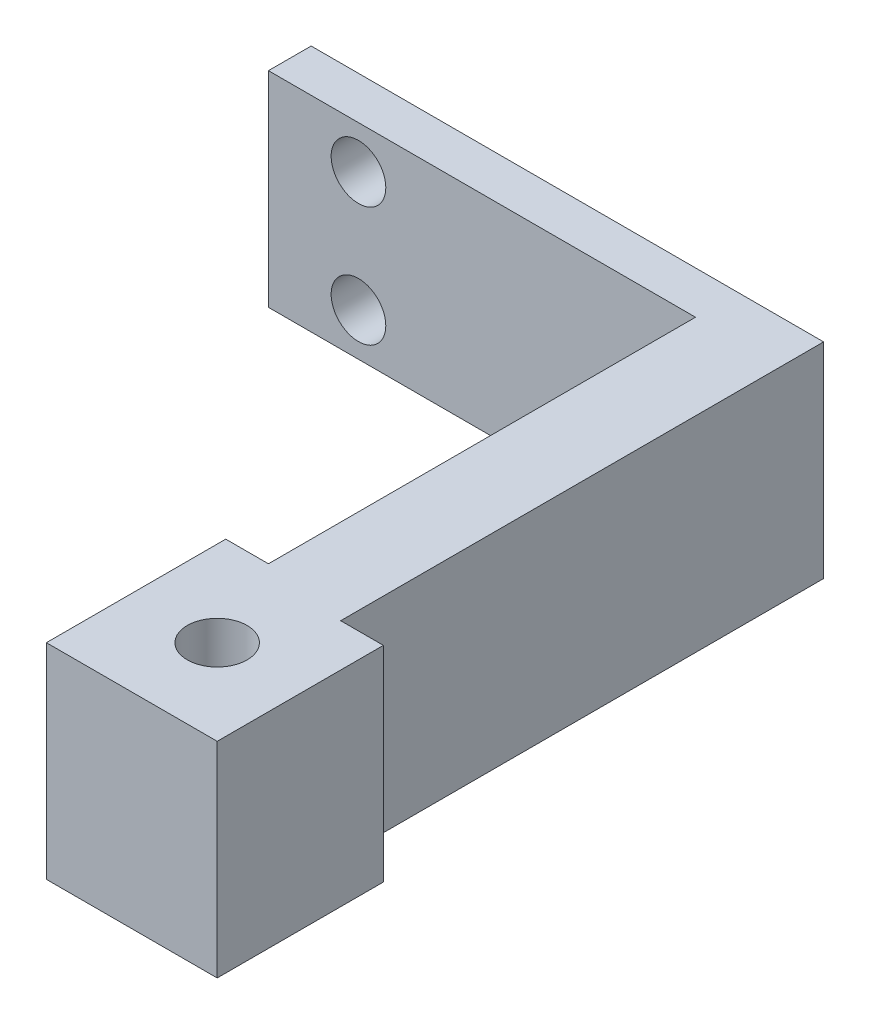
ISO-10303-21;
HEADER;
FILE_DESCRIPTION(('STEP AP214'),'2;1');
FILE_NAME('part.step','',(''),(''),'','','');
FILE_SCHEMA(('AUTOMOTIVE_DESIGN { 1 0 10303 214 1 1 1 1 }'));
ENDSEC;
DATA;
#1=APPLICATION_CONTEXT('core data for automotive mechanical design processes');
#2=APPLICATION_PROTOCOL_DEFINITION('international standard','automotive_design',2000,#1);
#3=PRODUCT_CONTEXT('',#1,'mechanical');
#4=PRODUCT('Part','Part','',(#3));
#5=PRODUCT_RELATED_PRODUCT_CATEGORY('part','',(#4));
#6=PRODUCT_DEFINITION_FORMATION('','',#4);
#7=PRODUCT_DEFINITION_CONTEXT('part definition',#1,'design');
#8=PRODUCT_DEFINITION('design','',#6,#7);
#9=PRODUCT_DEFINITION_SHAPE('','',#8);
#10=(LENGTH_UNIT() NAMED_UNIT(*) SI_UNIT(.MILLI.,.METRE.));
#11=(NAMED_UNIT(*) PLANE_ANGLE_UNIT() SI_UNIT($,.RADIAN.));
#12=(NAMED_UNIT(*) SI_UNIT($,.STERADIAN.) SOLID_ANGLE_UNIT());
#13=UNCERTAINTY_MEASURE_WITH_UNIT(LENGTH_MEASURE(1.E-05),#10,'distance_accuracy_value','');
#14=(GEOMETRIC_REPRESENTATION_CONTEXT(3) GLOBAL_UNCERTAINTY_ASSIGNED_CONTEXT((#13)) GLOBAL_UNIT_ASSIGNED_CONTEXT((#10,
#11,#12)) REPRESENTATION_CONTEXT('',''));
#15=CARTESIAN_POINT('',(0.,0.,0.));
#16=DIRECTION('',(0.,0.,1.));
#17=DIRECTION('',(1.,0.,0.));
#18=AXIS2_PLACEMENT_3D('',#15,#16,#17);
#19=CARTESIAN_POINT('',(-1.649648438219,12.,-29.2913223140496));
#20=DIRECTION('',(1.,0.,0.));
#21=DIRECTION('',(0.,0.,-1.));
#22=AXIS2_PLACEMENT_3D('',#19,#20,#21);
#23=PLANE('',#22);
#24=DIRECTION('',(0.,-1.,0.));
#25=VECTOR('',#24,1.);
#26=CARTESIAN_POINT('',(-1.649648438219,12.,-4.29132231404959));
#27=LINE('',#26,#25);
#28=CARTESIAN_POINT('',(-1.649648438219,12.,-4.29132231404959));
#29=VERTEX_POINT('',#28);
#30=CARTESIAN_POINT('',(-1.649648438219,0.,-4.29132231404959));
#31=VERTEX_POINT('',#30);
#32=EDGE_CURVE('E48',#29,#31,#27,.T.);
#33=ORIENTED_EDGE('',*,*,#32,.F.);
#34=DIRECTION('',(0.,0.,1.));
#35=VECTOR('',#34,1.);
#36=CARTESIAN_POINT('',(-1.649648438219,12.,-29.2913223140496));
#37=LINE('',#36,#35);
#38=CARTESIAN_POINT('',(-1.649648438219,12.,-29.2913223140496));
#39=VERTEX_POINT('',#38);
#40=EDGE_CURVE('E115',#39,#29,#37,.T.);
#41=ORIENTED_EDGE('',*,*,#40,.F.);
#42=DIRECTION('',(0.,-1.,0.));
#43=VECTOR('',#42,1.);
#44=CARTESIAN_POINT('',(-1.649648438219,12.,-29.2913223140496));
#45=LINE('',#44,#43);
#46=CARTESIAN_POINT('',(-1.649648438219,0.,-29.2913223140496));
#47=VERTEX_POINT('',#46);
#48=EDGE_CURVE('E11',#39,#47,#45,.T.);
#49=ORIENTED_EDGE('',*,*,#48,.T.);
#50=DIRECTION('',(0.,0.,1.));
#51=VECTOR('',#50,1.);
#52=CARTESIAN_POINT('',(-1.649648438219,0.,-29.2913223140496));
#53=LINE('',#52,#51);
#54=EDGE_CURVE('E52',#47,#31,#53,.T.);
#55=ORIENTED_EDGE('',*,*,#54,.T.);
#56=EDGE_LOOP('',(#33,#41,#49,#55));
#57=FACE_BOUND('',#56,.T.);
#58=ADVANCED_FACE('F33',(#57),#23,.F.);
#59=CARTESIAN_POINT('',(3.350351561781,12.,3.70867768595041));
#60=DIRECTION('',(-1.,0.,0.));
#61=DIRECTION('',(0.,0.,1.));
#62=AXIS2_PLACEMENT_3D('',#59,#60,#61);
#63=PLANE('',#62);
#64=DIRECTION('',(0.,-1.,0.));
#65=VECTOR('',#64,1.);
#66=CARTESIAN_POINT('',(3.350351561781,12.,-3.51907464645343));
#67=LINE('',#66,#65);
#68=CARTESIAN_POINT('',(3.350351561781,12.,-3.51907464645343));
#69=VERTEX_POINT('',#68);
#70=CARTESIAN_POINT('',(3.350351561781,0.,-3.51907464645343));
#71=VERTEX_POINT('',#70);
#72=EDGE_CURVE('E139',#69,#71,#67,.T.);
#73=ORIENTED_EDGE('',*,*,#72,.T.);
#74=DIRECTION('',(0.,0.,-1.));
#75=VECTOR('',#74,1.);
#76=CARTESIAN_POINT('',(3.350351561781,0.,3.70867768595041));
#77=LINE('',#76,#75);
#78=CARTESIAN_POINT('',(3.350351561781,0.,-31.7913223140496));
#79=VERTEX_POINT('',#78);
#80=EDGE_CURVE('E192',#71,#79,#77,.T.);
#81=ORIENTED_EDGE('',*,*,#80,.T.);
#82=DIRECTION('',(0.,-1.,0.));
#83=VECTOR('',#82,1.);
#84=CARTESIAN_POINT('',(3.350351561781,12.,-31.7913223140496));
#85=LINE('',#84,#83);
#86=CARTESIAN_POINT('',(3.350351561781,12.,-31.7913223140496));
#87=VERTEX_POINT('',#86);
#88=EDGE_CURVE('E41',#87,#79,#85,.T.);
#89=ORIENTED_EDGE('',*,*,#88,.F.);
#90=DIRECTION('',(0.,0.,-1.));
#91=VECTOR('',#90,1.);
#92=CARTESIAN_POINT('',(3.350351561781,12.,3.70867768595041));
#93=LINE('',#92,#91);
#94=EDGE_CURVE('E182',#69,#87,#93,.T.);
#95=ORIENTED_EDGE('',*,*,#94,.F.);
#96=EDGE_LOOP('',(#73,#81,#89,#95));
#97=FACE_BOUND('',#96,.T.);
#98=ADVANCED_FACE('F224',(#97),#63,.F.);
#99=CARTESIAN_POINT('',(0.,12.,0.));
#100=DIRECTION('',(0.,-1.,0.));
#101=DIRECTION('',(0.,0.,-1.));
#102=AXIS2_PLACEMENT_3D('',#99,#100,#101);
#103=PLANE('',#102);
#104=ORIENTED_EDGE('',*,*,#40,.T.);
#105=DIRECTION('',(-1.,0.,0.));
#106=VECTOR('',#105,1.);
#107=CARTESIAN_POINT('',(-1.649648438219,12.,-4.29132231404959));
#108=LINE('',#107,#106);
#109=CARTESIAN_POINT('',(-4.149648438219,12.,-4.29132231404959));
#110=VERTEX_POINT('',#109);
#111=EDGE_CURVE('E107',#29,#110,#108,.T.);
#112=ORIENTED_EDGE('',*,*,#111,.T.);
#113=DIRECTION('',(0.,0.,1.));
#114=VECTOR('',#113,1.);
#115=CARTESIAN_POINT('',(-4.149648438219,12.,-4.29132231404959));
#116=LINE('',#115,#114);
#117=CARTESIAN_POINT('',(-4.149648438219,12.,6.20867768595041));
#118=VERTEX_POINT('',#117);
#119=EDGE_CURVE('E112',#110,#118,#116,.T.);
#120=ORIENTED_EDGE('',*,*,#119,.T.);
#121=DIRECTION('',(1.,0.,0.));
#122=VECTOR('',#121,1.);
#123=CARTESIAN_POINT('',(-4.149648438219,12.,6.20867768595041));
#124=LINE('',#123,#122);
#125=CARTESIAN_POINT('',(5.850351561781,12.,6.20867768595041));
#126=VERTEX_POINT('',#125);
#127=EDGE_CURVE('E130',#118,#126,#124,.T.);
#128=ORIENTED_EDGE('',*,*,#127,.T.);
#129=DIRECTION('',(0.,0.,-1.));
#130=VECTOR('',#129,1.);
#131=CARTESIAN_POINT('',(5.850351561781,12.,6.20867768595041));
#132=LINE('',#131,#130);
#133=CARTESIAN_POINT('',(5.850351561781,12.,-3.51907464645343));
#134=VERTEX_POINT('',#133);
#135=EDGE_CURVE('E132',#126,#134,#132,.T.);
#136=ORIENTED_EDGE('',*,*,#135,.T.);
#137=DIRECTION('',(-1.,0.,0.));
#138=VECTOR('',#137,1.);
#139=CARTESIAN_POINT('',(5.850351561781,12.,-3.51907464645343));
#140=LINE('',#139,#138);
#141=EDGE_CURVE('E136',#134,#69,#140,.T.);
#142=ORIENTED_EDGE('',*,*,#141,.T.);
#143=ORIENTED_EDGE('',*,*,#94,.T.);
#144=DIRECTION('',(-1.,0.,0.));
#145=VECTOR('',#144,1.);
#146=CARTESIAN_POINT('',(3.350351561781,12.,-31.7913223140496));
#147=LINE('',#146,#145);
#148=CARTESIAN_POINT('',(-26.649648438219,12.,-31.7913223140496));
#149=VERTEX_POINT('',#148);
#150=EDGE_CURVE('E184',#87,#149,#147,.T.);
#151=ORIENTED_EDGE('',*,*,#150,.T.);
#152=DIRECTION('',(0.,0.,1.));
#153=VECTOR('',#152,1.);
#154=CARTESIAN_POINT('',(-26.649648438219,12.,-31.7913223140496));
#155=LINE('',#154,#153);
#156=CARTESIAN_POINT('',(-26.649648438219,12.,-29.2913223140496));
#157=VERTEX_POINT('',#156);
#158=EDGE_CURVE('E186',#149,#157,#155,.T.);
#159=ORIENTED_EDGE('',*,*,#158,.T.);
#160=DIRECTION('',(1.,0.,0.));
#161=VECTOR('',#160,1.);
#162=CARTESIAN_POINT('',(-26.649648438219,12.,-29.2913223140496));
#163=LINE('',#162,#161);
#164=EDGE_CURVE('E178',#157,#39,#163,.T.);
#165=ORIENTED_EDGE('',*,*,#164,.T.);
#166=EDGE_LOOP('',(#104,#112,#120,#128,#136,#142,#143,#151,#159,#165));
#167=FACE_BOUND('',#166,.T.);
#168=CARTESIAN_POINT('',(0.850351561781,12.,1.20867768595041));
#169=DIRECTION('',(0.,1.,0.));
#170=DIRECTION('',(0.,0.,1.));
#171=AXIS2_PLACEMENT_3D('',#168,#169,#170);
#172=CIRCLE('',#171,1.75);
#173=CARTESIAN_POINT('',(0.850351561781,12.,2.95867768595041));
#174=VERTEX_POINT('',#173);
#175=EDGE_CURVE('E172',#174,#174,#172,.T.);
#176=ORIENTED_EDGE('',*,*,#175,.F.);
#177=EDGE_LOOP('',(#176));
#178=FACE_BOUND('',#177,.T.);
#179=ADVANCED_FACE('F109',(#167,#178),#103,.F.);
#180=CARTESIAN_POINT('',(0.,0.,0.));
#181=DIRECTION('',(0.,-1.,0.));
#182=DIRECTION('',(0.,0.,-1.));
#183=AXIS2_PLACEMENT_3D('',#180,#181,#182);
#184=PLANE('',#183);
#185=DIRECTION('',(-1.,0.,0.));
#186=VECTOR('',#185,1.);
#187=CARTESIAN_POINT('',(-1.649648438219,0.,-4.29132231404959));
#188=LINE('',#187,#186);
#189=CARTESIAN_POINT('',(-4.149648438219,0.,-4.29132231404959));
#190=VERTEX_POINT('',#189);
#191=EDGE_CURVE('E122',#31,#190,#188,.T.);
#192=ORIENTED_EDGE('',*,*,#191,.F.);
#193=ORIENTED_EDGE('',*,*,#54,.F.);
#194=DIRECTION('',(1.,0.,0.));
#195=VECTOR('',#194,1.);
#196=CARTESIAN_POINT('',(-26.649648438219,0.,-29.2913223140496));
#197=LINE('',#196,#195);
#198=CARTESIAN_POINT('',(-26.649648438219,0.,-29.2913223140496));
#199=VERTEX_POINT('',#198);
#200=EDGE_CURVE('E175',#199,#47,#197,.T.);
#201=ORIENTED_EDGE('',*,*,#200,.F.);
#202=DIRECTION('',(0.,0.,1.));
#203=VECTOR('',#202,1.);
#204=CARTESIAN_POINT('',(-26.649648438219,0.,-31.7913223140496));
#205=LINE('',#204,#203);
#206=CARTESIAN_POINT('',(-26.649648438219,0.,-31.7913223140496));
#207=VERTEX_POINT('',#206);
#208=EDGE_CURVE('E180',#207,#199,#205,.T.);
#209=ORIENTED_EDGE('',*,*,#208,.F.);
#210=DIRECTION('',(-1.,0.,0.));
#211=VECTOR('',#210,1.);
#212=CARTESIAN_POINT('',(3.350351561781,0.,-31.7913223140496));
#213=LINE('',#212,#211);
#214=EDGE_CURVE('E194',#79,#207,#213,.T.);
#215=ORIENTED_EDGE('',*,*,#214,.F.);
#216=ORIENTED_EDGE('',*,*,#80,.F.);
#217=DIRECTION('',(-1.,0.,0.));
#218=VECTOR('',#217,1.);
#219=CARTESIAN_POINT('',(5.850351561781,0.,-3.51907464645343));
#220=LINE('',#219,#218);
#221=CARTESIAN_POINT('',(5.850351561781,0.,-3.51907464645343));
#222=VERTEX_POINT('',#221);
#223=EDGE_CURVE('E117',#222,#71,#220,.T.);
#224=ORIENTED_EDGE('',*,*,#223,.F.);
#225=DIRECTION('',(0.,0.,-1.));
#226=VECTOR('',#225,1.);
#227=CARTESIAN_POINT('',(5.850351561781,0.,6.20867768595041));
#228=LINE('',#227,#226);
#229=CARTESIAN_POINT('',(5.850351561781,0.,6.20867768595041));
#230=VERTEX_POINT('',#229);
#231=EDGE_CURVE('E145',#230,#222,#228,.T.);
#232=ORIENTED_EDGE('',*,*,#231,.F.);
#233=DIRECTION('',(1.,0.,0.));
#234=VECTOR('',#233,1.);
#235=CARTESIAN_POINT('',(-4.149648438219,0.,6.20867768595041));
#236=LINE('',#235,#234);
#237=CARTESIAN_POINT('',(-4.149648438219,0.,6.20867768595041));
#238=VERTEX_POINT('',#237);
#239=EDGE_CURVE('E143',#238,#230,#236,.T.);
#240=ORIENTED_EDGE('',*,*,#239,.F.);
#241=DIRECTION('',(0.,0.,1.));
#242=VECTOR('',#241,1.);
#243=CARTESIAN_POINT('',(-4.149648438219,0.,-4.29132231404959));
#244=LINE('',#243,#242);
#245=EDGE_CURVE('E141',#190,#238,#244,.T.);
#246=ORIENTED_EDGE('',*,*,#245,.F.);
#247=EDGE_LOOP('',(#192,#193,#201,#209,#215,#216,#224,#232,#240,#246));
#248=FACE_BOUND('',#247,.T.);
#249=CARTESIAN_POINT('',(0.850351561781,0.,1.20867768595041));
#250=DIRECTION('',(0.,1.,0.));
#251=DIRECTION('',(0.,0.,1.));
#252=AXIS2_PLACEMENT_3D('',#249,#250,#251);
#253=CIRCLE('',#252,1.75);
#254=CARTESIAN_POINT('',(0.850351561781,0.,2.95867768595041));
#255=VERTEX_POINT('',#254);
#256=EDGE_CURVE('E163',#255,#255,#253,.T.);
#257=ORIENTED_EDGE('',*,*,#256,.T.);
#258=EDGE_LOOP('',(#257));
#259=FACE_BOUND('',#258,.T.);
#260=ADVANCED_FACE('F211',(#248,#259),#184,.T.);
#261=CARTESIAN_POINT('',(-26.649648438219,12.,-29.2913223140496));
#262=DIRECTION('',(0.,0.,-1.));
#263=DIRECTION('',(-1.,0.,0.));
#264=AXIS2_PLACEMENT_3D('',#261,#262,#263);
#265=PLANE('',#264);
#266=CARTESIAN_POINT('',(-21.3797890691578,2.5,-29.2913223140496));
#267=DIRECTION('',(0.,0.,1.));
#268=DIRECTION('',(1.,0.,0.));
#269=AXIS2_PLACEMENT_3D('',#266,#267,#268);
#270=CIRCLE('',#269,1.6);
#271=CARTESIAN_POINT('',(-19.7797890691578,2.5,-29.2913223140496));
#272=VERTEX_POINT('',#271);
#273=EDGE_CURVE('E164',#272,#272,#270,.T.);
#274=ORIENTED_EDGE('',*,*,#273,.F.);
#275=EDGE_LOOP('',(#274));
#276=FACE_BOUND('',#275,.T.);
#277=CARTESIAN_POINT('',(-21.3797890691578,9.5,-29.2913223140496));
#278=DIRECTION('',(0.,0.,1.));
#279=DIRECTION('',(1.,0.,0.));
#280=AXIS2_PLACEMENT_3D('',#277,#278,#279);
#281=CIRCLE('',#280,1.6);
#282=CARTESIAN_POINT('',(-19.7797890691578,9.5,-29.2913223140496));
#283=VERTEX_POINT('',#282);
#284=EDGE_CURVE('E159',#283,#283,#281,.T.);
#285=ORIENTED_EDGE('',*,*,#284,.F.);
#286=EDGE_LOOP('',(#285));
#287=FACE_BOUND('',#286,.T.);
#288=ORIENTED_EDGE('',*,*,#200,.T.);
#289=ORIENTED_EDGE('',*,*,#48,.F.);
#290=ORIENTED_EDGE('',*,*,#164,.F.);
#291=DIRECTION('',(0.,-1.,0.));
#292=VECTOR('',#291,1.);
#293=CARTESIAN_POINT('',(-26.649648438219,12.,-29.2913223140496));
#294=LINE('',#293,#292);
#295=EDGE_CURVE('E188',#157,#199,#294,.T.);
#296=ORIENTED_EDGE('',*,*,#295,.T.);
#297=EDGE_LOOP('',(#288,#289,#290,#296));
#298=FACE_BOUND('',#297,.T.);
#299=ADVANCED_FACE('F35',(#276,#287,#298),#265,.F.);
#300=CARTESIAN_POINT('',(3.350351561781,12.,-31.7913223140496));
#301=DIRECTION('',(0.,0.,1.));
#302=DIRECTION('',(1.,0.,0.));
#303=AXIS2_PLACEMENT_3D('',#300,#301,#302);
#304=PLANE('',#303);
#305=CARTESIAN_POINT('',(-21.3797890691578,2.5,-31.7913223140496));
#306=DIRECTION('',(0.,0.,1.));
#307=DIRECTION('',(1.,0.,0.));
#308=AXIS2_PLACEMENT_3D('',#305,#306,#307);
#309=CIRCLE('',#308,1.6);
#310=CARTESIAN_POINT('',(-19.7797890691578,2.5,-31.7913223140496));
#311=VERTEX_POINT('',#310);
#312=EDGE_CURVE('E160',#311,#311,#309,.T.);
#313=ORIENTED_EDGE('',*,*,#312,.T.);
#314=EDGE_LOOP('',(#313));
#315=FACE_BOUND('',#314,.T.);
#316=CARTESIAN_POINT('',(-21.3797890691578,9.5,-31.7913223140496));
#317=DIRECTION('',(0.,0.,1.));
#318=DIRECTION('',(1.,0.,0.));
#319=AXIS2_PLACEMENT_3D('',#316,#317,#318);
#320=CIRCLE('',#319,1.6);
#321=CARTESIAN_POINT('',(-19.7797890691578,9.5,-31.7913223140496));
#322=VERTEX_POINT('',#321);
#323=EDGE_CURVE('E167',#322,#322,#320,.T.);
#324=ORIENTED_EDGE('',*,*,#323,.T.);
#325=EDGE_LOOP('',(#324));
#326=FACE_BOUND('',#325,.T.);
#327=ORIENTED_EDGE('',*,*,#214,.T.);
#328=DIRECTION('',(0.,-1.,0.));
#329=VECTOR('',#328,1.);
#330=CARTESIAN_POINT('',(-26.649648438219,12.,-31.7913223140496));
#331=LINE('',#330,#329);
#332=EDGE_CURVE('E199',#149,#207,#331,.T.);
#333=ORIENTED_EDGE('',*,*,#332,.F.);
#334=ORIENTED_EDGE('',*,*,#150,.F.);
#335=ORIENTED_EDGE('',*,*,#88,.T.);
#336=EDGE_LOOP('',(#327,#333,#334,#335));
#337=FACE_BOUND('',#336,.T.);
#338=ADVANCED_FACE('F206',(#315,#326,#337),#304,.F.);
#339=CARTESIAN_POINT('',(-26.649648438219,12.,-31.7913223140496));
#340=DIRECTION('',(1.,0.,0.));
#341=DIRECTION('',(0.,0.,-1.));
#342=AXIS2_PLACEMENT_3D('',#339,#340,#341);
#343=PLANE('',#342);
#344=ORIENTED_EDGE('',*,*,#208,.T.);
#345=ORIENTED_EDGE('',*,*,#295,.F.);
#346=ORIENTED_EDGE('',*,*,#158,.F.);
#347=ORIENTED_EDGE('',*,*,#332,.T.);
#348=EDGE_LOOP('',(#344,#345,#346,#347));
#349=FACE_BOUND('',#348,.T.);
#350=ADVANCED_FACE('F217',(#349),#343,.F.);
#351=CARTESIAN_POINT('',(0.850351561781,12.,1.20867768595041));
#352=DIRECTION('',(0.,-1.,0.));
#353=DIRECTION('',(0.,0.,-1.));
#354=AXIS2_PLACEMENT_3D('',#351,#352,#353);
#355=CYLINDRICAL_SURFACE('',#354,1.75);
#356=ORIENTED_EDGE('',*,*,#175,.T.);
#357=EDGE_LOOP('',(#356));
#358=FACE_BOUND('',#357,.T.);
#359=ORIENTED_EDGE('',*,*,#256,.F.);
#360=EDGE_LOOP('',(#359));
#361=FACE_BOUND('',#360,.T.);
#362=ADVANCED_FACE('F255',(#358,#361),#355,.F.);
#363=CARTESIAN_POINT('',(-21.3797890691578,9.5,-31.7913223140496));
#364=DIRECTION('',(0.,0.,1.));
#365=DIRECTION('',(1.,0.,0.));
#366=AXIS2_PLACEMENT_3D('',#363,#364,#365);
#367=CYLINDRICAL_SURFACE('',#366,1.6);
#368=ORIENTED_EDGE('',*,*,#323,.F.);
#369=EDGE_LOOP('',(#368));
#370=FACE_BOUND('',#369,.T.);
#371=ORIENTED_EDGE('',*,*,#284,.T.);
#372=EDGE_LOOP('',(#371));
#373=FACE_BOUND('',#372,.T.);
#374=ADVANCED_FACE('F262',(#370,#373),#367,.F.);
#375=CARTESIAN_POINT('',(-21.3797890691578,2.5,-31.7913223140496));
#376=DIRECTION('',(0.,0.,1.));
#377=DIRECTION('',(1.,0.,0.));
#378=AXIS2_PLACEMENT_3D('',#375,#376,#377);
#379=CYLINDRICAL_SURFACE('',#378,1.6);
#380=ORIENTED_EDGE('',*,*,#312,.F.);
#381=EDGE_LOOP('',(#380));
#382=FACE_BOUND('',#381,.T.);
#383=ORIENTED_EDGE('',*,*,#273,.T.);
#384=EDGE_LOOP('',(#383));
#385=FACE_BOUND('',#384,.T.);
#386=ADVANCED_FACE('F266',(#382,#385),#379,.F.);
#387=CARTESIAN_POINT('',(-1.649648438219,12.,-4.29132231404959));
#388=DIRECTION('',(0.,0.,1.));
#389=DIRECTION('',(1.,0.,0.));
#390=AXIS2_PLACEMENT_3D('',#387,#388,#389);
#391=PLANE('',#390);
#392=ORIENTED_EDGE('',*,*,#191,.T.);
#393=DIRECTION('',(0.,-1.,0.));
#394=VECTOR('',#393,1.);
#395=CARTESIAN_POINT('',(-4.149648438219,12.,-4.29132231404959));
#396=LINE('',#395,#394);
#397=EDGE_CURVE('E120',#110,#190,#396,.T.);
#398=ORIENTED_EDGE('',*,*,#397,.F.);
#399=ORIENTED_EDGE('',*,*,#111,.F.);
#400=ORIENTED_EDGE('',*,*,#32,.T.);
#401=EDGE_LOOP('',(#392,#398,#399,#400));
#402=FACE_BOUND('',#401,.T.);
#403=ADVANCED_FACE('F121',(#402),#391,.F.);
#404=CARTESIAN_POINT('',(-4.149648438219,12.,-4.29132231404959));
#405=DIRECTION('',(1.,0.,0.));
#406=DIRECTION('',(0.,0.,-1.));
#407=AXIS2_PLACEMENT_3D('',#404,#405,#406);
#408=PLANE('',#407);
#409=ORIENTED_EDGE('',*,*,#245,.T.);
#410=DIRECTION('',(0.,-1.,0.));
#411=VECTOR('',#410,1.);
#412=CARTESIAN_POINT('',(-4.149648438219,12.,6.20867768595041));
#413=LINE('',#412,#411);
#414=EDGE_CURVE('E125',#118,#238,#413,.T.);
#415=ORIENTED_EDGE('',*,*,#414,.F.);
#416=ORIENTED_EDGE('',*,*,#119,.F.);
#417=ORIENTED_EDGE('',*,*,#397,.T.);
#418=EDGE_LOOP('',(#409,#415,#416,#417));
#419=FACE_BOUND('',#418,.T.);
#420=ADVANCED_FACE('F127',(#419),#408,.F.);
#421=CARTESIAN_POINT('',(-4.149648438219,12.,6.20867768595041));
#422=DIRECTION('',(0.,0.,-1.));
#423=DIRECTION('',(-1.,0.,0.));
#424=AXIS2_PLACEMENT_3D('',#421,#422,#423);
#425=PLANE('',#424);
#426=ORIENTED_EDGE('',*,*,#239,.T.);
#427=DIRECTION('',(0.,-1.,0.));
#428=VECTOR('',#427,1.);
#429=CARTESIAN_POINT('',(5.850351561781,12.,6.20867768595041));
#430=LINE('',#429,#428);
#431=EDGE_CURVE('E154',#126,#230,#430,.T.);
#432=ORIENTED_EDGE('',*,*,#431,.F.);
#433=ORIENTED_EDGE('',*,*,#127,.F.);
#434=ORIENTED_EDGE('',*,*,#414,.T.);
#435=EDGE_LOOP('',(#426,#432,#433,#434));
#436=FACE_BOUND('',#435,.T.);
#437=ADVANCED_FACE('F235',(#436),#425,.F.);
#438=CARTESIAN_POINT('',(5.850351561781,12.,6.20867768595041));
#439=DIRECTION('',(-1.,0.,0.));
#440=DIRECTION('',(0.,0.,1.));
#441=AXIS2_PLACEMENT_3D('',#438,#439,#440);
#442=PLANE('',#441);
#443=ORIENTED_EDGE('',*,*,#231,.T.);
#444=DIRECTION('',(0.,-1.,0.));
#445=VECTOR('',#444,1.);
#446=CARTESIAN_POINT('',(5.850351561781,12.,-3.51907464645343));
#447=LINE('',#446,#445);
#448=EDGE_CURVE('E151',#134,#222,#447,.T.);
#449=ORIENTED_EDGE('',*,*,#448,.F.);
#450=ORIENTED_EDGE('',*,*,#135,.F.);
#451=ORIENTED_EDGE('',*,*,#431,.T.);
#452=EDGE_LOOP('',(#443,#449,#450,#451));
#453=FACE_BOUND('',#452,.T.);
#454=ADVANCED_FACE('F231',(#453),#442,.F.);
#455=CARTESIAN_POINT('',(5.850351561781,12.,-3.51907464645343));
#456=DIRECTION('',(0.,0.,1.));
#457=DIRECTION('',(1.,0.,0.));
#458=AXIS2_PLACEMENT_3D('',#455,#456,#457);
#459=PLANE('',#458);
#460=ORIENTED_EDGE('',*,*,#223,.T.);
#461=ORIENTED_EDGE('',*,*,#72,.F.);
#462=ORIENTED_EDGE('',*,*,#141,.F.);
#463=ORIENTED_EDGE('',*,*,#448,.T.);
#464=EDGE_LOOP('',(#460,#461,#462,#463));
#465=FACE_BOUND('',#464,.T.);
#466=ADVANCED_FACE('F226',(#465),#459,.F.);
#467=CLOSED_SHELL('',(#58,#98,#179,#260,#299,#338,#350,#362,#374,#386,#403,#420,#437,#454,#466));
#468=MANIFOLD_SOLID_BREP('B2',#467);
#469=ADVANCED_BREP_SHAPE_REPRESENTATION('',(#18,#468),#14);
#470=SHAPE_DEFINITION_REPRESENTATION(#9,#469);
ENDSEC;
END-ISO-10303-21;
